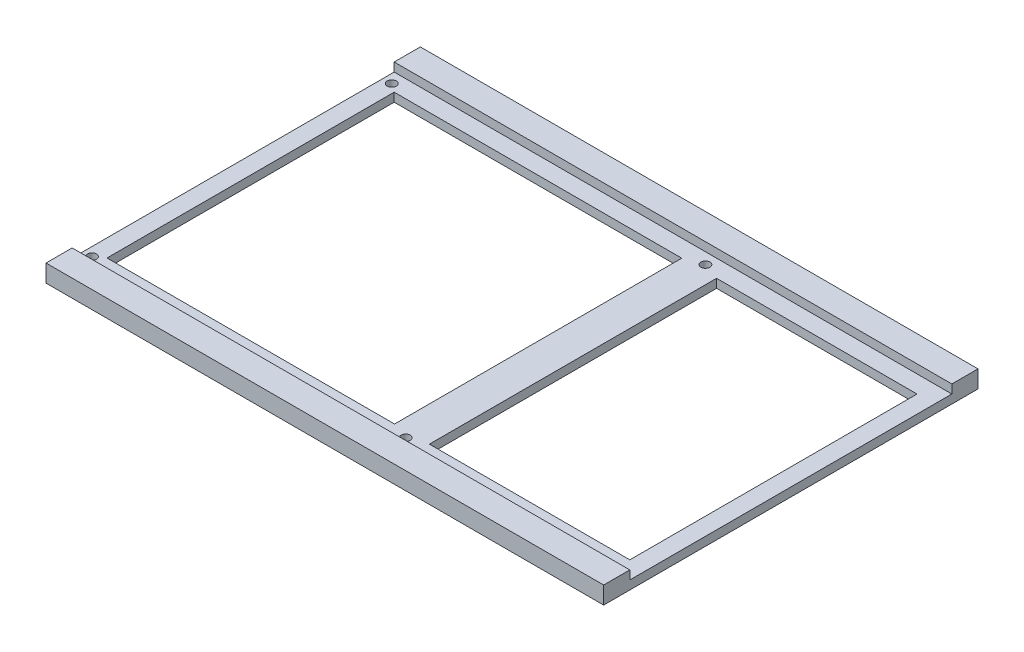
ISO-10303-21;
HEADER;
FILE_DESCRIPTION(('STEP AP214'),'2;1');
FILE_NAME('part.step','',(''),(''),'','','');
FILE_SCHEMA(('AUTOMOTIVE_DESIGN { 1 0 10303 214 1 1 1 1 }'));
ENDSEC;
DATA;
#1=APPLICATION_CONTEXT('core data for automotive mechanical design processes');
#2=APPLICATION_PROTOCOL_DEFINITION('international standard','automotive_design',2000,#1);
#3=PRODUCT_CONTEXT('',#1,'mechanical');
#4=PRODUCT('Part','Part','',(#3));
#5=PRODUCT_RELATED_PRODUCT_CATEGORY('part','',(#4));
#6=PRODUCT_DEFINITION_FORMATION('','',#4);
#7=PRODUCT_DEFINITION_CONTEXT('part definition',#1,'design');
#8=PRODUCT_DEFINITION('design','',#6,#7);
#9=PRODUCT_DEFINITION_SHAPE('','',#8);
#10=(LENGTH_UNIT() NAMED_UNIT(*) SI_UNIT(.MILLI.,.METRE.));
#11=(NAMED_UNIT(*) PLANE_ANGLE_UNIT() SI_UNIT($,.RADIAN.));
#12=(NAMED_UNIT(*) SI_UNIT($,.STERADIAN.) SOLID_ANGLE_UNIT());
#13=UNCERTAINTY_MEASURE_WITH_UNIT(LENGTH_MEASURE(1.E-05),#10,'distance_accuracy_value','');
#14=(GEOMETRIC_REPRESENTATION_CONTEXT(3) GLOBAL_UNCERTAINTY_ASSIGNED_CONTEXT((#13)) GLOBAL_UNIT_ASSIGNED_CONTEXT((#10,
#11,#12)) REPRESENTATION_CONTEXT('',''));
#15=CARTESIAN_POINT('',(0.,0.,0.));
#16=DIRECTION('',(0.,0.,1.));
#17=DIRECTION('',(1.,0.,0.));
#18=AXIS2_PLACEMENT_3D('',#15,#16,#17);
#19=CARTESIAN_POINT('',(0.,0.,0.));
#20=DIRECTION('',(0.,1.,0.));
#21=DIRECTION('',(0.,0.,1.));
#22=AXIS2_PLACEMENT_3D('',#19,#20,#21);
#23=PLANE('',#22);
#24=CARTESIAN_POINT('',(-98.425,0.,54.61));
#25=DIRECTION('',(0.,1.,0.));
#26=DIRECTION('',(0.,0.,1.));
#27=AXIS2_PLACEMENT_3D('',#24,#25,#26);
#28=CIRCLE('',#27,1.64999999999998);
#29=CARTESIAN_POINT('',(-98.425,0.,56.26));
#30=VERTEX_POINT('',#29);
#31=EDGE_CURVE('E291',#30,#30,#28,.T.);
#32=ORIENTED_EDGE('',*,*,#31,.T.);
#33=EDGE_LOOP('',(#32));
#34=FACE_BOUND('',#33,.T.);
#35=CARTESIAN_POINT('',(-98.425,0.,-54.61));
#36=DIRECTION('',(0.,1.,0.));
#37=DIRECTION('',(0.,0.,1.));
#38=AXIS2_PLACEMENT_3D('',#35,#36,#37);
#39=CIRCLE('',#38,1.64999999999998);
#40=CARTESIAN_POINT('',(-98.425,0.,-52.96));
#41=VERTEX_POINT('',#40);
#42=EDGE_CURVE('E39',#41,#41,#39,.T.);
#43=ORIENTED_EDGE('',*,*,#42,.T.);
#44=EDGE_LOOP('',(#43));
#45=FACE_BOUND('',#44,.T.);
#46=CARTESIAN_POINT('',(15.875,0.,-54.61));
#47=DIRECTION('',(0.,1.,0.));
#48=DIRECTION('',(0.,0.,1.));
#49=AXIS2_PLACEMENT_3D('',#46,#47,#48);
#50=CIRCLE('',#49,1.64999999999999);
#51=CARTESIAN_POINT('',(15.875,0.,-52.96));
#52=VERTEX_POINT('',#51);
#53=EDGE_CURVE('E278',#52,#52,#50,.T.);
#54=ORIENTED_EDGE('',*,*,#53,.T.);
#55=EDGE_LOOP('',(#54));
#56=FACE_BOUND('',#55,.T.);
#57=CARTESIAN_POINT('',(15.875,0.,54.61));
#58=DIRECTION('',(0.,1.,0.));
#59=DIRECTION('',(0.,0.,1.));
#60=AXIS2_PLACEMENT_3D('',#57,#58,#59);
#61=CIRCLE('',#60,1.64999999999999);
#62=CARTESIAN_POINT('',(15.875,0.,56.26));
#63=VERTEX_POINT('',#62);
#64=EDGE_CURVE('E179',#63,#63,#61,.T.);
#65=ORIENTED_EDGE('',*,*,#64,.T.);
#66=EDGE_LOOP('',(#65));
#67=FACE_BOUND('',#66,.T.);
#68=DIRECTION('',(-1.,0.,0.));
#69=VECTOR('',#68,1.);
#70=CARTESIAN_POINT('',(0.,0.,52.324));
#71=LINE('',#70,#69);
#72=CARTESIAN_POINT('',(9.52499999999998,0.,52.324));
#73=VERTEX_POINT('',#72);
#74=CARTESIAN_POINT('',(-95.25,0.,52.324));
#75=VERTEX_POINT('',#74);
#76=EDGE_CURVE('E189',#73,#75,#71,.T.);
#77=ORIENTED_EDGE('',*,*,#76,.F.);
#78=DIRECTION('',(0.,0.,-1.));
#79=VECTOR('',#78,1.);
#80=CARTESIAN_POINT('',(9.52499999999998,0.,0.));
#81=LINE('',#80,#79);
#82=CARTESIAN_POINT('',(9.52499999999996,0.,-52.324));
#83=VERTEX_POINT('',#82);
#84=EDGE_CURVE('E191',#73,#83,#81,.T.);
#85=ORIENTED_EDGE('',*,*,#84,.T.);
#86=DIRECTION('',(-1.,0.,0.));
#87=VECTOR('',#86,1.);
#88=CARTESIAN_POINT('',(0.,0.,-52.324));
#89=LINE('',#88,#87);
#90=CARTESIAN_POINT('',(-95.25,0.,-52.324));
#91=VERTEX_POINT('',#90);
#92=EDGE_CURVE('E195',#83,#91,#89,.T.);
#93=ORIENTED_EDGE('',*,*,#92,.T.);
#94=DIRECTION('',(0.,0.,-1.));
#95=VECTOR('',#94,1.);
#96=CARTESIAN_POINT('',(-95.25,0.,0.));
#97=LINE('',#96,#95);
#98=EDGE_CURVE('E198',#75,#91,#97,.T.);
#99=ORIENTED_EDGE('',*,*,#98,.F.);
#100=EDGE_LOOP('',(#77,#85,#93,#99));
#101=FACE_BOUND('',#100,.T.);
#102=DIRECTION('',(0.,0.,1.));
#103=VECTOR('',#102,1.);
#104=CARTESIAN_POINT('',(-101.6,0.,68.199));
#105=LINE('',#104,#103);
#106=CARTESIAN_POINT('',(-101.6,0.,-68.199));
#107=VERTEX_POINT('',#106);
#108=CARTESIAN_POINT('',(-101.6,0.,68.199));
#109=VERTEX_POINT('',#108);
#110=EDGE_CURVE('E240',#107,#109,#105,.T.);
#111=ORIENTED_EDGE('',*,*,#110,.F.);
#112=DIRECTION('',(-1.,0.,0.));
#113=VECTOR('',#112,1.);
#114=CARTESIAN_POINT('',(101.6,0.,-68.199));
#115=LINE('',#114,#113);
#116=CARTESIAN_POINT('',(101.6,0.,-68.199));
#117=VERTEX_POINT('',#116);
#118=EDGE_CURVE('E266',#117,#107,#115,.T.);
#119=ORIENTED_EDGE('',*,*,#118,.F.);
#120=DIRECTION('',(0.,0.,-1.));
#121=VECTOR('',#120,1.);
#122=CARTESIAN_POINT('',(101.6,0.,68.199));
#123=LINE('',#122,#121);
#124=CARTESIAN_POINT('',(101.6,0.,68.199));
#125=VERTEX_POINT('',#124);
#126=EDGE_CURVE('E264',#125,#117,#123,.T.);
#127=ORIENTED_EDGE('',*,*,#126,.F.);
#128=DIRECTION('',(1.,0.,0.));
#129=VECTOR('',#128,1.);
#130=CARTESIAN_POINT('',(101.6,0.,68.199));
#131=LINE('',#130,#129);
#132=EDGE_CURVE('E262',#109,#125,#131,.T.);
#133=ORIENTED_EDGE('',*,*,#132,.F.);
#134=EDGE_LOOP('',(#111,#119,#127,#133));
#135=FACE_BOUND('',#134,.T.);
#136=DIRECTION('',(0.,0.,-1.));
#137=VECTOR('',#136,1.);
#138=CARTESIAN_POINT('',(22.225,0.,0.));
#139=LINE('',#138,#137);
#140=CARTESIAN_POINT('',(22.225,0.,52.324));
#141=VERTEX_POINT('',#140);
#142=CARTESIAN_POINT('',(22.225,0.,-52.324));
#143=VERTEX_POINT('',#142);
#144=EDGE_CURVE('E158',#141,#143,#139,.T.);
#145=ORIENTED_EDGE('',*,*,#144,.F.);
#146=DIRECTION('',(-1.,0.,0.));
#147=VECTOR('',#146,1.);
#148=CARTESIAN_POINT('',(0.,0.,52.324));
#149=LINE('',#148,#147);
#150=CARTESIAN_POINT('',(95.25,0.,52.324));
#151=VERTEX_POINT('',#150);
#152=EDGE_CURVE('E150',#151,#141,#149,.T.);
#153=ORIENTED_EDGE('',*,*,#152,.F.);
#154=DIRECTION('',(0.,0.,-1.));
#155=VECTOR('',#154,1.);
#156=CARTESIAN_POINT('',(95.25,0.,0.));
#157=LINE('',#156,#155);
#158=CARTESIAN_POINT('',(95.25,0.,-52.324));
#159=VERTEX_POINT('',#158);
#160=EDGE_CURVE('E52',#151,#159,#157,.T.);
#161=ORIENTED_EDGE('',*,*,#160,.T.);
#162=DIRECTION('',(-1.,0.,0.));
#163=VECTOR('',#162,1.);
#164=CARTESIAN_POINT('',(0.,0.,-52.324));
#165=LINE('',#164,#163);
#166=EDGE_CURVE('E162',#159,#143,#165,.T.);
#167=ORIENTED_EDGE('',*,*,#166,.T.);
#168=EDGE_LOOP('',(#145,#153,#161,#167));
#169=FACE_BOUND('',#168,.T.);
#170=ADVANCED_FACE('F35',(#34,#45,#56,#67,#101,#135,#169),#23,.F.);
#171=CARTESIAN_POINT('',(-101.6,3.175,-58.674));
#172=DIRECTION('',(0.,-1.,0.));
#173=DIRECTION('',(0.,0.,-1.));
#174=AXIS2_PLACEMENT_3D('',#171,#172,#173);
#175=PLANE('',#174);
#176=CARTESIAN_POINT('',(-98.425,3.175,54.61));
#177=DIRECTION('',(0.,1.,0.));
#178=DIRECTION('',(0.,0.,1.));
#179=AXIS2_PLACEMENT_3D('',#176,#177,#178);
#180=CIRCLE('',#179,1.64999999999998);
#181=CARTESIAN_POINT('',(-98.425,3.175,56.26));
#182=VERTEX_POINT('',#181);
#183=EDGE_CURVE('E294',#182,#182,#180,.T.);
#184=ORIENTED_EDGE('',*,*,#183,.F.);
#185=EDGE_LOOP('',(#184));
#186=FACE_BOUND('',#185,.T.);
#187=CARTESIAN_POINT('',(-98.425,3.175,-54.61));
#188=DIRECTION('',(0.,1.,0.));
#189=DIRECTION('',(0.,0.,1.));
#190=AXIS2_PLACEMENT_3D('',#187,#188,#189);
#191=CIRCLE('',#190,1.64999999999998);
#192=CARTESIAN_POINT('',(-98.425,3.175,-52.96));
#193=VERTEX_POINT('',#192);
#194=EDGE_CURVE('E288',#193,#193,#191,.T.);
#195=ORIENTED_EDGE('',*,*,#194,.F.);
#196=EDGE_LOOP('',(#195));
#197=FACE_BOUND('',#196,.T.);
#198=CARTESIAN_POINT('',(15.875,3.175,-54.61));
#199=DIRECTION('',(0.,1.,0.));
#200=DIRECTION('',(0.,0.,1.));
#201=AXIS2_PLACEMENT_3D('',#198,#199,#200);
#202=CIRCLE('',#201,1.64999999999999);
#203=CARTESIAN_POINT('',(15.875,3.175,-52.96));
#204=VERTEX_POINT('',#203);
#205=EDGE_CURVE('E282',#204,#204,#202,.T.);
#206=ORIENTED_EDGE('',*,*,#205,.F.);
#207=EDGE_LOOP('',(#206));
#208=FACE_BOUND('',#207,.T.);
#209=CARTESIAN_POINT('',(15.875,3.175,54.61));
#210=DIRECTION('',(0.,1.,0.));
#211=DIRECTION('',(0.,0.,1.));
#212=AXIS2_PLACEMENT_3D('',#209,#210,#211);
#213=CIRCLE('',#212,1.64999999999999);
#214=CARTESIAN_POINT('',(15.875,3.175,56.26));
#215=VERTEX_POINT('',#214);
#216=EDGE_CURVE('E172',#215,#215,#213,.T.);
#217=ORIENTED_EDGE('',*,*,#216,.F.);
#218=EDGE_LOOP('',(#217));
#219=FACE_BOUND('',#218,.T.);
#220=DIRECTION('',(-1.,0.,0.));
#221=VECTOR('',#220,1.);
#222=CARTESIAN_POINT('',(0.,3.175,52.324));
#223=LINE('',#222,#221);
#224=CARTESIAN_POINT('',(9.52499999999999,3.175,52.324));
#225=VERTEX_POINT('',#224);
#226=CARTESIAN_POINT('',(-95.25,3.175,52.324));
#227=VERTEX_POINT('',#226);
#228=EDGE_CURVE('E185',#225,#227,#223,.T.);
#229=ORIENTED_EDGE('',*,*,#228,.T.);
#230=DIRECTION('',(0.,0.,-1.));
#231=VECTOR('',#230,1.);
#232=CARTESIAN_POINT('',(-95.25,3.175,0.));
#233=LINE('',#232,#231);
#234=CARTESIAN_POINT('',(-95.25,3.175,-52.324));
#235=VERTEX_POINT('',#234);
#236=EDGE_CURVE('E192',#227,#235,#233,.T.);
#237=ORIENTED_EDGE('',*,*,#236,.T.);
#238=DIRECTION('',(-1.,0.,0.));
#239=VECTOR('',#238,1.);
#240=CARTESIAN_POINT('',(0.,3.175,-52.324));
#241=LINE('',#240,#239);
#242=CARTESIAN_POINT('',(9.52499999999998,3.175,-52.324));
#243=VERTEX_POINT('',#242);
#244=EDGE_CURVE('E206',#243,#235,#241,.T.);
#245=ORIENTED_EDGE('',*,*,#244,.F.);
#246=DIRECTION('',(0.,0.,-1.));
#247=VECTOR('',#246,1.);
#248=CARTESIAN_POINT('',(9.52499999999998,3.175,0.));
#249=LINE('',#248,#247);
#250=EDGE_CURVE('E203',#225,#243,#249,.T.);
#251=ORIENTED_EDGE('',*,*,#250,.F.);
#252=EDGE_LOOP('',(#229,#237,#245,#251));
#253=FACE_BOUND('',#252,.T.);
#254=DIRECTION('',(0.,0.,-1.));
#255=VECTOR('',#254,1.);
#256=CARTESIAN_POINT('',(101.6,3.175,-58.674));
#257=LINE('',#256,#255);
#258=CARTESIAN_POINT('',(101.6,3.175,58.674));
#259=VERTEX_POINT('',#258);
#260=CARTESIAN_POINT('',(101.6,3.175,-58.674));
#261=VERTEX_POINT('',#260);
#262=EDGE_CURVE('E234',#259,#261,#257,.T.);
#263=ORIENTED_EDGE('',*,*,#262,.T.);
#264=DIRECTION('',(1.,0.,0.));
#265=VECTOR('',#264,1.);
#266=CARTESIAN_POINT('',(-101.6,3.175,-58.674));
#267=LINE('',#266,#265);
#268=CARTESIAN_POINT('',(-101.6,3.175,-58.674));
#269=VERTEX_POINT('',#268);
#270=EDGE_CURVE('E244',#269,#261,#267,.T.);
#271=ORIENTED_EDGE('',*,*,#270,.F.);
#272=DIRECTION('',(0.,0.,-1.));
#273=VECTOR('',#272,1.);
#274=CARTESIAN_POINT('',(-101.6,3.175,-58.674));
#275=LINE('',#274,#273);
#276=CARTESIAN_POINT('',(-101.6,3.175,58.674));
#277=VERTEX_POINT('',#276);
#278=EDGE_CURVE('E224',#277,#269,#275,.T.);
#279=ORIENTED_EDGE('',*,*,#278,.F.);
#280=DIRECTION('',(1.,0.,0.));
#281=VECTOR('',#280,1.);
#282=CARTESIAN_POINT('',(-101.6,3.175,58.674));
#283=LINE('',#282,#281);
#284=EDGE_CURVE('E231',#277,#259,#283,.T.);
#285=ORIENTED_EDGE('',*,*,#284,.T.);
#286=EDGE_LOOP('',(#263,#271,#279,#285));
#287=FACE_BOUND('',#286,.T.);
#288=DIRECTION('',(0.,0.,-1.));
#289=VECTOR('',#288,1.);
#290=CARTESIAN_POINT('',(22.225,3.175,0.));
#291=LINE('',#290,#289);
#292=CARTESIAN_POINT('',(22.225,3.175,52.324));
#293=VERTEX_POINT('',#292);
#294=CARTESIAN_POINT('',(22.225,3.175,-52.324));
#295=VERTEX_POINT('',#294);
#296=EDGE_CURVE('E60',#293,#295,#291,.T.);
#297=ORIENTED_EDGE('',*,*,#296,.T.);
#298=DIRECTION('',(-1.,0.,0.));
#299=VECTOR('',#298,1.);
#300=CARTESIAN_POINT('',(0.,3.175,-52.324));
#301=LINE('',#300,#299);
#302=CARTESIAN_POINT('',(95.25,3.175,-52.324));
#303=VERTEX_POINT('',#302);
#304=EDGE_CURVE('E166',#303,#295,#301,.T.);
#305=ORIENTED_EDGE('',*,*,#304,.F.);
#306=DIRECTION('',(0.,0.,-1.));
#307=VECTOR('',#306,1.);
#308=CARTESIAN_POINT('',(95.25,3.175,0.));
#309=LINE('',#308,#307);
#310=CARTESIAN_POINT('',(95.25,3.175,52.324));
#311=VERTEX_POINT('',#310);
#312=EDGE_CURVE('E169',#311,#303,#309,.T.);
#313=ORIENTED_EDGE('',*,*,#312,.F.);
#314=DIRECTION('',(-1.,0.,0.));
#315=VECTOR('',#314,1.);
#316=CARTESIAN_POINT('',(0.,3.175,52.324));
#317=LINE('',#316,#315);
#318=EDGE_CURVE('E178',#311,#293,#317,.T.);
#319=ORIENTED_EDGE('',*,*,#318,.T.);
#320=EDGE_LOOP('',(#297,#305,#313,#319));
#321=FACE_BOUND('',#320,.T.);
#322=ADVANCED_FACE('F301',(#186,#197,#208,#219,#253,#287,#321),#175,.F.);
#323=CARTESIAN_POINT('',(0.,6.35,0.));
#324=DIRECTION('',(0.,1.,0.));
#325=DIRECTION('',(0.,0.,1.));
#326=AXIS2_PLACEMENT_3D('',#323,#324,#325);
#327=PLANE('',#326);
#328=DIRECTION('',(1.,0.,0.));
#329=VECTOR('',#328,1.);
#330=CARTESIAN_POINT('',(-101.6,6.35,58.674));
#331=LINE('',#330,#329);
#332=CARTESIAN_POINT('',(-101.6,6.35,58.674));
#333=VERTEX_POINT('',#332);
#334=CARTESIAN_POINT('',(101.6,6.35,58.674));
#335=VERTEX_POINT('',#334);
#336=EDGE_CURVE('E238',#333,#335,#331,.T.);
#337=ORIENTED_EDGE('',*,*,#336,.F.);
#338=DIRECTION('',(0.,0.,1.));
#339=VECTOR('',#338,1.);
#340=CARTESIAN_POINT('',(-101.6,6.35,68.199));
#341=LINE('',#340,#339);
#342=CARTESIAN_POINT('',(-101.6,6.35,68.199));
#343=VERTEX_POINT('',#342);
#344=EDGE_CURVE('E251',#333,#343,#341,.T.);
#345=ORIENTED_EDGE('',*,*,#344,.T.);
#346=DIRECTION('',(1.,0.,0.));
#347=VECTOR('',#346,1.);
#348=CARTESIAN_POINT('',(101.6,6.35,68.199));
#349=LINE('',#348,#347);
#350=CARTESIAN_POINT('',(101.6,6.35,68.199));
#351=VERTEX_POINT('',#350);
#352=EDGE_CURVE('E250',#343,#351,#349,.T.);
#353=ORIENTED_EDGE('',*,*,#352,.T.);
#354=DIRECTION('',(0.,0.,-1.));
#355=VECTOR('',#354,1.);
#356=CARTESIAN_POINT('',(101.6,6.35,68.199));
#357=LINE('',#356,#355);
#358=EDGE_CURVE('E254',#351,#335,#357,.T.);
#359=ORIENTED_EDGE('',*,*,#358,.T.);
#360=EDGE_LOOP('',(#337,#345,#353,#359));
#361=FACE_BOUND('',#360,.T.);
#362=ADVANCED_FACE('F304',(#361),#327,.T.);
#363=CARTESIAN_POINT('',(-101.6,6.35,68.199));
#364=DIRECTION('',(1.,0.,0.));
#365=DIRECTION('',(0.,0.,-1.));
#366=AXIS2_PLACEMENT_3D('',#363,#364,#365);
#367=PLANE('',#366);
#368=ORIENTED_EDGE('',*,*,#344,.F.);
#369=DIRECTION('',(0.,-1.,0.));
#370=VECTOR('',#369,1.);
#371=CARTESIAN_POINT('',(-101.6,3.175,58.674));
#372=LINE('',#371,#370);
#373=EDGE_CURVE('E221',#333,#277,#372,.T.);
#374=ORIENTED_EDGE('',*,*,#373,.T.);
#375=ORIENTED_EDGE('',*,*,#278,.T.);
#376=DIRECTION('',(0.,1.,0.));
#377=VECTOR('',#376,1.);
#378=CARTESIAN_POINT('',(-101.6,3.175,-58.674));
#379=LINE('',#378,#377);
#380=CARTESIAN_POINT('',(-101.6,6.35,-58.674));
#381=VERTEX_POINT('',#380);
#382=EDGE_CURVE('E228',#269,#381,#379,.T.);
#383=ORIENTED_EDGE('',*,*,#382,.T.);
#384=CARTESIAN_POINT('',(-101.6,6.35,-68.199));
#385=VERTEX_POINT('',#384);
#386=EDGE_CURVE('E247',#385,#381,#341,.T.);
#387=ORIENTED_EDGE('',*,*,#386,.F.);
#388=DIRECTION('',(0.,-1.,0.));
#389=VECTOR('',#388,1.);
#390=CARTESIAN_POINT('',(-101.6,6.35,-68.199));
#391=LINE('',#390,#389);
#392=EDGE_CURVE('E259',#385,#107,#391,.T.);
#393=ORIENTED_EDGE('',*,*,#392,.T.);
#394=ORIENTED_EDGE('',*,*,#110,.T.);
#395=DIRECTION('',(0.,-1.,0.));
#396=VECTOR('',#395,1.);
#397=CARTESIAN_POINT('',(-101.6,6.35,68.199));
#398=LINE('',#397,#396);
#399=EDGE_CURVE('E11',#343,#109,#398,.T.);
#400=ORIENTED_EDGE('',*,*,#399,.F.);
#401=EDGE_LOOP('',(#368,#374,#375,#383,#387,#393,#394,#400));
#402=FACE_BOUND('',#401,.T.);
#403=ADVANCED_FACE('F37',(#402),#367,.F.);
#404=CARTESIAN_POINT('',(101.6,6.35,68.199));
#405=DIRECTION('',(0.,0.,-1.));
#406=DIRECTION('',(-1.,0.,0.));
#407=AXIS2_PLACEMENT_3D('',#404,#405,#406);
#408=PLANE('',#407);
#409=ORIENTED_EDGE('',*,*,#132,.T.);
#410=DIRECTION('',(0.,-1.,0.));
#411=VECTOR('',#410,1.);
#412=CARTESIAN_POINT('',(101.6,6.35,68.199));
#413=LINE('',#412,#411);
#414=EDGE_CURVE('E44',#351,#125,#413,.T.);
#415=ORIENTED_EDGE('',*,*,#414,.F.);
#416=ORIENTED_EDGE('',*,*,#352,.F.);
#417=ORIENTED_EDGE('',*,*,#399,.T.);
#418=EDGE_LOOP('',(#409,#415,#416,#417));
#419=FACE_BOUND('',#418,.T.);
#420=ADVANCED_FACE('F347',(#419),#408,.F.);
#421=CARTESIAN_POINT('',(101.6,6.35,68.199));
#422=DIRECTION('',(-1.,0.,0.));
#423=DIRECTION('',(0.,0.,1.));
#424=AXIS2_PLACEMENT_3D('',#421,#422,#423);
#425=PLANE('',#424);
#426=ORIENTED_EDGE('',*,*,#262,.F.);
#427=DIRECTION('',(0.,-1.,0.));
#428=VECTOR('',#427,1.);
#429=CARTESIAN_POINT('',(101.6,3.175,58.674));
#430=LINE('',#429,#428);
#431=EDGE_CURVE('E214',#335,#259,#430,.T.);
#432=ORIENTED_EDGE('',*,*,#431,.F.);
#433=ORIENTED_EDGE('',*,*,#358,.F.);
#434=ORIENTED_EDGE('',*,*,#414,.T.);
#435=ORIENTED_EDGE('',*,*,#126,.T.);
#436=DIRECTION('',(0.,-1.,0.));
#437=VECTOR('',#436,1.);
#438=CARTESIAN_POINT('',(101.6,6.35,-68.199));
#439=LINE('',#438,#437);
#440=CARTESIAN_POINT('',(101.6,6.35,-68.199));
#441=VERTEX_POINT('',#440);
#442=EDGE_CURVE('E270',#441,#117,#439,.T.);
#443=ORIENTED_EDGE('',*,*,#442,.F.);
#444=CARTESIAN_POINT('',(101.6,6.35,-58.674));
#445=VERTEX_POINT('',#444);
#446=EDGE_CURVE('E253',#445,#441,#357,.T.);
#447=ORIENTED_EDGE('',*,*,#446,.F.);
#448=DIRECTION('',(0.,1.,0.));
#449=VECTOR('',#448,1.);
#450=CARTESIAN_POINT('',(101.6,3.175,-58.674));
#451=LINE('',#450,#449);
#452=EDGE_CURVE('E225',#261,#445,#451,.T.);
#453=ORIENTED_EDGE('',*,*,#452,.F.);
#454=EDGE_LOOP('',(#426,#432,#433,#434,#435,#443,#447,#453));
#455=FACE_BOUND('',#454,.T.);
#456=ADVANCED_FACE('F344',(#455),#425,.F.);
#457=CARTESIAN_POINT('',(101.6,6.35,-68.199));
#458=DIRECTION('',(0.,0.,1.));
#459=DIRECTION('',(1.,0.,0.));
#460=AXIS2_PLACEMENT_3D('',#457,#458,#459);
#461=PLANE('',#460);
#462=ORIENTED_EDGE('',*,*,#118,.T.);
#463=ORIENTED_EDGE('',*,*,#392,.F.);
#464=DIRECTION('',(-1.,0.,0.));
#465=VECTOR('',#464,1.);
#466=CARTESIAN_POINT('',(101.6,6.35,-68.199));
#467=LINE('',#466,#465);
#468=EDGE_CURVE('E257',#441,#385,#467,.T.);
#469=ORIENTED_EDGE('',*,*,#468,.F.);
#470=ORIENTED_EDGE('',*,*,#442,.T.);
#471=EDGE_LOOP('',(#462,#463,#469,#470));
#472=FACE_BOUND('',#471,.T.);
#473=ADVANCED_FACE('F341',(#472),#461,.F.);
#474=DIRECTION('',(1.,0.,0.));
#475=VECTOR('',#474,1.);
#476=CARTESIAN_POINT('',(-101.6,6.35,-58.674));
#477=LINE('',#476,#475);
#478=EDGE_CURVE('E241',#381,#445,#477,.T.);
#479=ORIENTED_EDGE('',*,*,#478,.T.);
#480=ORIENTED_EDGE('',*,*,#446,.T.);
#481=ORIENTED_EDGE('',*,*,#468,.T.);
#482=ORIENTED_EDGE('',*,*,#386,.T.);
#483=EDGE_LOOP('',(#479,#480,#481,#482));
#484=FACE_BOUND('',#483,.T.);
#485=ADVANCED_FACE('F339',(#484),#327,.T.);
#486=CARTESIAN_POINT('',(-101.6,3.175,58.674));
#487=DIRECTION('',(0.,0.,1.));
#488=DIRECTION('',(1.,0.,0.));
#489=AXIS2_PLACEMENT_3D('',#486,#487,#488);
#490=PLANE('',#489);
#491=ORIENTED_EDGE('',*,*,#431,.T.);
#492=ORIENTED_EDGE('',*,*,#284,.F.);
#493=ORIENTED_EDGE('',*,*,#373,.F.);
#494=ORIENTED_EDGE('',*,*,#336,.T.);
#495=EDGE_LOOP('',(#491,#492,#493,#494));
#496=FACE_BOUND('',#495,.T.);
#497=ADVANCED_FACE('F377',(#496),#490,.F.);
#498=CARTESIAN_POINT('',(-101.6,3.175,-58.674));
#499=DIRECTION('',(0.,0.,-1.));
#500=DIRECTION('',(-1.,0.,0.));
#501=AXIS2_PLACEMENT_3D('',#498,#499,#500);
#502=PLANE('',#501);
#503=ORIENTED_EDGE('',*,*,#452,.T.);
#504=ORIENTED_EDGE('',*,*,#478,.F.);
#505=ORIENTED_EDGE('',*,*,#382,.F.);
#506=ORIENTED_EDGE('',*,*,#270,.T.);
#507=EDGE_LOOP('',(#503,#504,#505,#506));
#508=FACE_BOUND('',#507,.T.);
#509=ADVANCED_FACE('F373',(#508),#502,.F.);
#510=CARTESIAN_POINT('',(0.,0.,52.324));
#511=DIRECTION('',(0.,0.,-1.));
#512=DIRECTION('',(-1.,0.,0.));
#513=AXIS2_PLACEMENT_3D('',#510,#511,#512);
#514=PLANE('',#513);
#515=ORIENTED_EDGE('',*,*,#228,.F.);
#516=DIRECTION('',(0.,1.,0.));
#517=VECTOR('',#516,1.);
#518=CARTESIAN_POINT('',(9.52499999999998,0.,52.324));
#519=LINE('',#518,#517);
#520=EDGE_CURVE('E200',#73,#225,#519,.T.);
#521=ORIENTED_EDGE('',*,*,#520,.F.);
#522=ORIENTED_EDGE('',*,*,#76,.T.);
#523=DIRECTION('',(0.,1.,0.));
#524=VECTOR('',#523,1.);
#525=CARTESIAN_POINT('',(-95.25,0.,52.324));
#526=LINE('',#525,#524);
#527=EDGE_CURVE('E211',#75,#227,#526,.T.);
#528=ORIENTED_EDGE('',*,*,#527,.T.);
#529=EDGE_LOOP('',(#515,#521,#522,#528));
#530=FACE_BOUND('',#529,.T.);
#531=ADVANCED_FACE('F389',(#530),#514,.T.);
#532=CARTESIAN_POINT('',(-95.25,0.,0.));
#533=DIRECTION('',(1.,0.,0.));
#534=DIRECTION('',(0.,0.,-1.));
#535=AXIS2_PLACEMENT_3D('',#532,#533,#534);
#536=PLANE('',#535);
#537=ORIENTED_EDGE('',*,*,#236,.F.);
#538=ORIENTED_EDGE('',*,*,#527,.F.);
#539=ORIENTED_EDGE('',*,*,#98,.T.);
#540=DIRECTION('',(0.,1.,0.));
#541=VECTOR('',#540,1.);
#542=CARTESIAN_POINT('',(-95.25,0.,-52.324));
#543=LINE('',#542,#541);
#544=EDGE_CURVE('E215',#91,#235,#543,.T.);
#545=ORIENTED_EDGE('',*,*,#544,.T.);
#546=EDGE_LOOP('',(#537,#538,#539,#545));
#547=FACE_BOUND('',#546,.T.);
#548=ADVANCED_FACE('F394',(#547),#536,.T.);
#549=CARTESIAN_POINT('',(0.,0.,-52.324));
#550=DIRECTION('',(0.,0.,-1.));
#551=DIRECTION('',(-1.,0.,0.));
#552=AXIS2_PLACEMENT_3D('',#549,#550,#551);
#553=PLANE('',#552);
#554=ORIENTED_EDGE('',*,*,#244,.T.);
#555=ORIENTED_EDGE('',*,*,#544,.F.);
#556=ORIENTED_EDGE('',*,*,#92,.F.);
#557=DIRECTION('',(0.,1.,0.));
#558=VECTOR('',#557,1.);
#559=CARTESIAN_POINT('',(9.52499999999998,0.,-52.324));
#560=LINE('',#559,#558);
#561=EDGE_CURVE('E217',#83,#243,#560,.T.);
#562=ORIENTED_EDGE('',*,*,#561,.T.);
#563=EDGE_LOOP('',(#554,#555,#556,#562));
#564=FACE_BOUND('',#563,.T.);
#565=ADVANCED_FACE('F398',(#564),#553,.F.);
#566=CARTESIAN_POINT('',(9.52499999999998,0.,0.));
#567=DIRECTION('',(1.,0.,0.));
#568=DIRECTION('',(0.,0.,-1.));
#569=AXIS2_PLACEMENT_3D('',#566,#567,#568);
#570=PLANE('',#569);
#571=ORIENTED_EDGE('',*,*,#250,.T.);
#572=ORIENTED_EDGE('',*,*,#561,.F.);
#573=ORIENTED_EDGE('',*,*,#84,.F.);
#574=ORIENTED_EDGE('',*,*,#520,.T.);
#575=EDGE_LOOP('',(#571,#572,#573,#574));
#576=FACE_BOUND('',#575,.T.);
#577=ADVANCED_FACE('F328',(#576),#570,.F.);
#578=CARTESIAN_POINT('',(22.225,0.,0.));
#579=DIRECTION('',(1.,0.,0.));
#580=DIRECTION('',(0.,0.,-1.));
#581=AXIS2_PLACEMENT_3D('',#578,#579,#580);
#582=PLANE('',#581);
#583=ORIENTED_EDGE('',*,*,#296,.F.);
#584=DIRECTION('',(0.,1.,0.));
#585=VECTOR('',#584,1.);
#586=CARTESIAN_POINT('',(22.225,0.,52.324));
#587=LINE('',#586,#585);
#588=EDGE_CURVE('E153',#141,#293,#587,.T.);
#589=ORIENTED_EDGE('',*,*,#588,.F.);
#590=ORIENTED_EDGE('',*,*,#144,.T.);
#591=DIRECTION('',(0.,1.,0.));
#592=VECTOR('',#591,1.);
#593=CARTESIAN_POINT('',(22.225,0.,-52.324));
#594=LINE('',#593,#592);
#595=EDGE_CURVE('E183',#143,#295,#594,.T.);
#596=ORIENTED_EDGE('',*,*,#595,.T.);
#597=EDGE_LOOP('',(#583,#589,#590,#596));
#598=FACE_BOUND('',#597,.T.);
#599=ADVANCED_FACE('F160',(#598),#582,.T.);
#600=CARTESIAN_POINT('',(0.,0.,-52.324));
#601=DIRECTION('',(0.,0.,-1.));
#602=DIRECTION('',(-1.,0.,0.));
#603=AXIS2_PLACEMENT_3D('',#600,#601,#602);
#604=PLANE('',#603);
#605=ORIENTED_EDGE('',*,*,#304,.T.);
#606=ORIENTED_EDGE('',*,*,#595,.F.);
#607=ORIENTED_EDGE('',*,*,#166,.F.);
#608=DIRECTION('',(0.,1.,0.));
#609=VECTOR('',#608,1.);
#610=CARTESIAN_POINT('',(95.25,0.,-52.324));
#611=LINE('',#610,#609);
#612=EDGE_CURVE('E186',#159,#303,#611,.T.);
#613=ORIENTED_EDGE('',*,*,#612,.T.);
#614=EDGE_LOOP('',(#605,#606,#607,#613));
#615=FACE_BOUND('',#614,.T.);
#616=ADVANCED_FACE('F320',(#615),#604,.F.);
#617=CARTESIAN_POINT('',(95.25,0.,0.));
#618=DIRECTION('',(1.,0.,0.));
#619=DIRECTION('',(0.,0.,-1.));
#620=AXIS2_PLACEMENT_3D('',#617,#618,#619);
#621=PLANE('',#620);
#622=ORIENTED_EDGE('',*,*,#312,.T.);
#623=ORIENTED_EDGE('',*,*,#612,.F.);
#624=ORIENTED_EDGE('',*,*,#160,.F.);
#625=DIRECTION('',(0.,1.,0.));
#626=VECTOR('',#625,1.);
#627=CARTESIAN_POINT('',(95.25,0.,52.324));
#628=LINE('',#627,#626);
#629=EDGE_CURVE('E155',#151,#311,#628,.T.);
#630=ORIENTED_EDGE('',*,*,#629,.T.);
#631=EDGE_LOOP('',(#622,#623,#624,#630));
#632=FACE_BOUND('',#631,.T.);
#633=ADVANCED_FACE('F318',(#632),#621,.F.);
#634=CARTESIAN_POINT('',(0.,0.,52.324));
#635=DIRECTION('',(0.,0.,-1.));
#636=DIRECTION('',(-1.,0.,0.));
#637=AXIS2_PLACEMENT_3D('',#634,#635,#636);
#638=PLANE('',#637);
#639=ORIENTED_EDGE('',*,*,#318,.F.);
#640=ORIENTED_EDGE('',*,*,#629,.F.);
#641=ORIENTED_EDGE('',*,*,#152,.T.);
#642=ORIENTED_EDGE('',*,*,#588,.T.);
#643=EDGE_LOOP('',(#639,#640,#641,#642));
#644=FACE_BOUND('',#643,.T.);
#645=ADVANCED_FACE('F152',(#644),#638,.T.);
#646=CARTESIAN_POINT('',(15.875,3.175,54.61));
#647=DIRECTION('',(0.,1.,0.));
#648=DIRECTION('',(0.,0.,1.));
#649=AXIS2_PLACEMENT_3D('',#646,#647,#648);
#650=CYLINDRICAL_SURFACE('',#649,1.64999999999999);
#651=ORIENTED_EDGE('',*,*,#216,.T.);
#652=EDGE_LOOP('',(#651));
#653=FACE_BOUND('',#652,.T.);
#654=ORIENTED_EDGE('',*,*,#64,.F.);
#655=EDGE_LOOP('',(#654));
#656=FACE_BOUND('',#655,.T.);
#657=ADVANCED_FACE('F407',(#653,#656),#650,.F.);
#658=CARTESIAN_POINT('',(15.875,3.175,-54.61));
#659=DIRECTION('',(0.,1.,0.));
#660=DIRECTION('',(0.,0.,1.));
#661=AXIS2_PLACEMENT_3D('',#658,#659,#660);
#662=CYLINDRICAL_SURFACE('',#661,1.64999999999999);
#663=ORIENTED_EDGE('',*,*,#205,.T.);
#664=EDGE_LOOP('',(#663));
#665=FACE_BOUND('',#664,.T.);
#666=ORIENTED_EDGE('',*,*,#53,.F.);
#667=EDGE_LOOP('',(#666));
#668=FACE_BOUND('',#667,.T.);
#669=ADVANCED_FACE('F411',(#665,#668),#662,.F.);
#670=CARTESIAN_POINT('',(-98.425,3.175,-54.61));
#671=DIRECTION('',(0.,1.,0.));
#672=DIRECTION('',(0.,0.,1.));
#673=AXIS2_PLACEMENT_3D('',#670,#671,#672);
#674=CYLINDRICAL_SURFACE('',#673,1.64999999999998);
#675=ORIENTED_EDGE('',*,*,#194,.T.);
#676=EDGE_LOOP('',(#675));
#677=FACE_BOUND('',#676,.T.);
#678=ORIENTED_EDGE('',*,*,#42,.F.);
#679=EDGE_LOOP('',(#678));
#680=FACE_BOUND('',#679,.T.);
#681=ADVANCED_FACE('F415',(#677,#680),#674,.F.);
#682=CARTESIAN_POINT('',(-98.425,3.175,54.61));
#683=DIRECTION('',(0.,1.,0.));
#684=DIRECTION('',(0.,0.,1.));
#685=AXIS2_PLACEMENT_3D('',#682,#683,#684);
#686=CYLINDRICAL_SURFACE('',#685,1.64999999999998);
#687=ORIENTED_EDGE('',*,*,#183,.T.);
#688=EDGE_LOOP('',(#687));
#689=FACE_BOUND('',#688,.T.);
#690=ORIENTED_EDGE('',*,*,#31,.F.);
#691=EDGE_LOOP('',(#690));
#692=FACE_BOUND('',#691,.T.);
#693=ADVANCED_FACE('F298',(#689,#692),#686,.F.);
#694=CLOSED_SHELL('',(#170,#322,#362,#403,#420,#456,#473,#485,#497,#509,#531,#548,#565,#577,
#599,#616,#633,#645,#657,#669,#681,#693));
#695=MANIFOLD_SOLID_BREP('B2',#694);
#696=ADVANCED_BREP_SHAPE_REPRESENTATION('',(#18,#695),#14);
#697=SHAPE_DEFINITION_REPRESENTATION(#9,#696);
ENDSEC;
END-ISO-10303-21;
